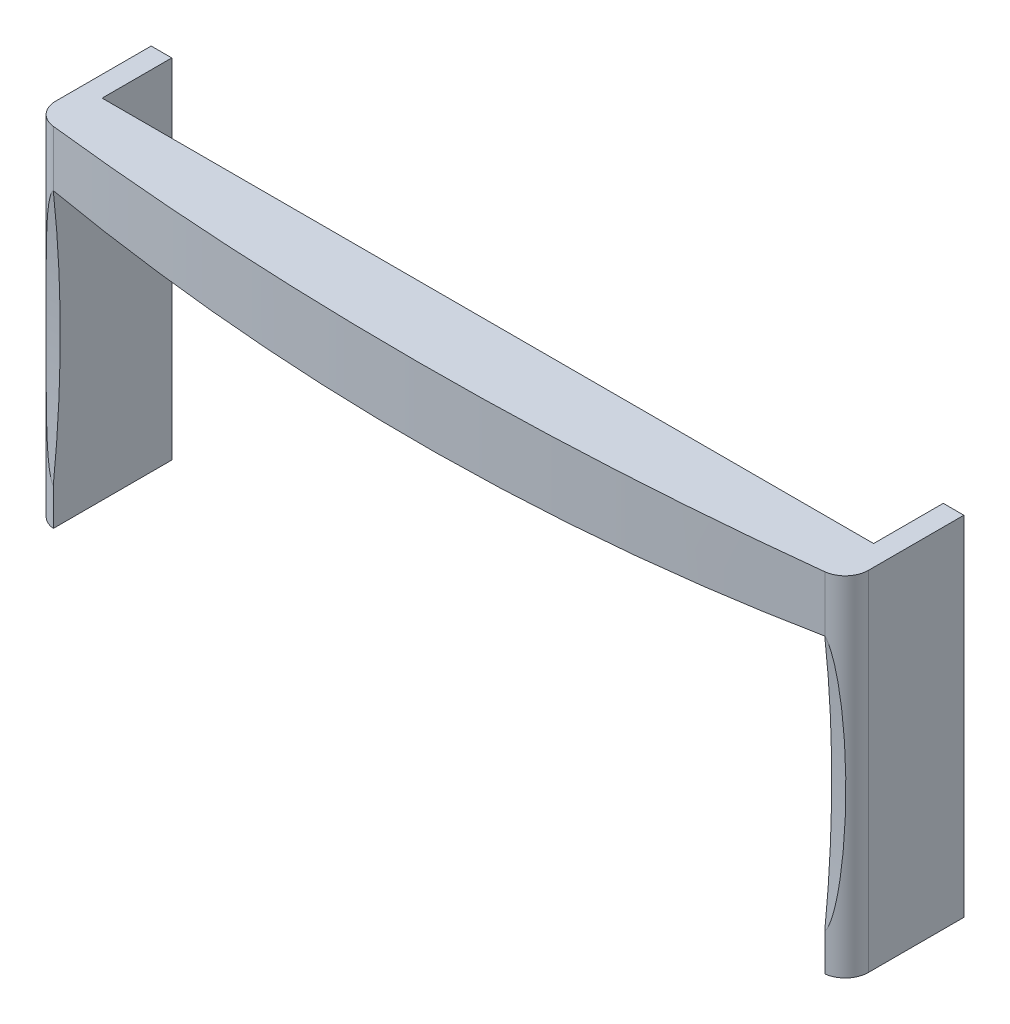
ISO-10303-21;
HEADER;
FILE_DESCRIPTION(('STEP AP214'),'2;1');
FILE_NAME('part.step','',(''),(''),'','','');
FILE_SCHEMA(('AUTOMOTIVE_DESIGN { 1 0 10303 214 1 1 1 1 }'));
ENDSEC;
DATA;
#1=APPLICATION_CONTEXT('core data for automotive mechanical design processes');
#2=APPLICATION_PROTOCOL_DEFINITION('international standard','automotive_design',2000,#1);
#3=PRODUCT_CONTEXT('',#1,'mechanical');
#4=PRODUCT('Part','Part','',(#3));
#5=PRODUCT_RELATED_PRODUCT_CATEGORY('part','',(#4));
#6=PRODUCT_DEFINITION_FORMATION('','',#4);
#7=PRODUCT_DEFINITION_CONTEXT('part definition',#1,'design');
#8=PRODUCT_DEFINITION('design','',#6,#7);
#9=PRODUCT_DEFINITION_SHAPE('','',#8);
#10=(LENGTH_UNIT() NAMED_UNIT(*) SI_UNIT(.MILLI.,.METRE.));
#11=(NAMED_UNIT(*) PLANE_ANGLE_UNIT() SI_UNIT($,.RADIAN.));
#12=(NAMED_UNIT(*) SI_UNIT($,.STERADIAN.) SOLID_ANGLE_UNIT());
#13=UNCERTAINTY_MEASURE_WITH_UNIT(LENGTH_MEASURE(1.E-05),#10,'distance_accuracy_value','');
#14=(GEOMETRIC_REPRESENTATION_CONTEXT(3) GLOBAL_UNCERTAINTY_ASSIGNED_CONTEXT((#13)) GLOBAL_UNIT_ASSIGNED_CONTEXT((#10,
#11,#12)) REPRESENTATION_CONTEXT('',''));
#15=CARTESIAN_POINT('',(0.,0.,0.));
#16=DIRECTION('',(0.,0.,1.));
#17=DIRECTION('',(1.,0.,0.));
#18=AXIS2_PLACEMENT_3D('',#15,#16,#17);
#19=CARTESIAN_POINT('',(-87.5,75.,-12.5));
#20=DIRECTION('',(0.,0.,1.));
#21=DIRECTION('',(1.,0.,0.));
#22=AXIS2_PLACEMENT_3D('',#19,#20,#21);
#23=PLANE('',#22);
#24=DIRECTION('',(0.,-1.,0.));
#25=VECTOR('',#24,1.);
#26=CARTESIAN_POINT('',(-83.0623255897939,75.,-12.5));
#27=LINE('',#26,#25);
#28=CARTESIAN_POINT('',(-83.0623255897939,75.,-12.5));
#29=VERTEX_POINT('',#28);
#30=CARTESIAN_POINT('',(-83.0623255897939,63.,-12.5));
#31=VERTEX_POINT('',#30);
#32=EDGE_CURVE('E57',#29,#31,#27,.T.);
#33=ORIENTED_EDGE('',*,*,#32,.F.);
#34=DIRECTION('',(-1.,0.,0.));
#35=VECTOR('',#34,1.);
#36=CARTESIAN_POINT('',(-87.5,75.,-12.5));
#37=LINE('',#36,#35);
#38=CARTESIAN_POINT('',(83.0623255897938,75.,-12.5));
#39=VERTEX_POINT('',#38);
#40=EDGE_CURVE('E144',#39,#29,#37,.T.);
#41=ORIENTED_EDGE('',*,*,#40,.F.);
#42=DIRECTION('',(0.,1.,0.));
#43=VECTOR('',#42,1.);
#44=CARTESIAN_POINT('',(83.0623255897938,75.,-12.5));
#45=LINE('',#44,#43);
#46=CARTESIAN_POINT('',(83.0623255897938,63.,-12.5));
#47=VERTEX_POINT('',#46);
#48=EDGE_CURVE('E11',#47,#39,#45,.T.);
#49=ORIENTED_EDGE('',*,*,#48,.F.);
#50=CARTESIAN_POINT('',(-2.63677968348475E-13,1211.39165539748,-12.5));
#51=DIRECTION('',(0.,0.,-1.));
#52=DIRECTION('',(1.,0.,0.));
#53=AXIS2_PLACEMENT_3D('',#50,#51,#52);
#54=CIRCLE('',#53,1151.39165539748);
#55=EDGE_CURVE('E332',#47,#31,#54,.T.);
#56=ORIENTED_EDGE('',*,*,#55,.T.);
#57=EDGE_LOOP('',(#33,#41,#49,#56));
#58=FACE_BOUND('',#57,.T.);
#59=ADVANCED_FACE('F39',(#58),#23,.F.);
#60=CARTESIAN_POINT('',(-2.63677968348475E-13,1211.39165539748,-12.5));
#61=DIRECTION('',(0.,0.,1.));
#62=DIRECTION('',(1.,0.,0.));
#63=AXIS2_PLACEMENT_3D('',#60,#61,#62);
#64=CYLINDRICAL_SURFACE('',#63,1151.39165539748);
#65=DIRECTION('',(0.,0.,1.));
#66=VECTOR('',#65,1.);
#67=CARTESIAN_POINT('',(83.0623255897938,63.,-12.5));
#68=LINE('',#67,#66);
#69=CARTESIAN_POINT('',(83.0623255897938,63.,-1.98413144461507));
#70=VERTEX_POINT('',#69);
#71=EDGE_CURVE('E264',#47,#70,#68,.T.);
#72=ORIENTED_EDGE('',*,*,#71,.T.);
#73=CARTESIAN_POINT('',(83.0623255897936,63.0000000000002,-1.98413144461507));
#74=CARTESIAN_POINT('',(79.6051969151284,62.7499484267229,-2.01148651599017));
#75=CARTESIAN_POINT('',(76.1469426278477,62.5155082683895,-2.03676580314133));
#76=CARTESIAN_POINT('',(69.2284320718336,62.0778676198134,-2.08341384557539));
#77=CARTESIAN_POINT('',(65.7681758034121,61.874667124705,-2.10478260146737));
#78=CARTESIAN_POINT('',(55.3848543274694,61.3119545118768,-2.16338419825874));
#79=CARTESIAN_POINT('',(48.4591584769483,60.9993256270347,-2.19511297428076));
#80=CARTESIAN_POINT('',(34.6123573935238,60.4995395141887,-2.2452736413921));
#81=CARTESIAN_POINT('',(27.6912581041578,60.3122177939343,-2.2637229670076));
#82=CARTESIAN_POINT('',(13.8467725436177,60.0624480194924,-2.28822859928558));
#83=CARTESIAN_POINT('',(6.92338627180859,60.,-2.29428490250476));
#84=CARTESIAN_POINT('',(-6.92338627180956,60.,-2.29428490250479));
#85=CARTESIAN_POINT('',(-13.8467725436186,60.0624480194924,-2.28822859928564));
#86=CARTESIAN_POINT('',(-27.6912581041588,60.3122177939343,-2.26372296700764));
#87=CARTESIAN_POINT('',(-34.6123573935248,60.4995395141887,-2.24527364139208));
#88=CARTESIAN_POINT('',(-48.4591584769493,60.9993256270346,-2.19511297428075));
#89=CARTESIAN_POINT('',(-55.3848543274704,61.3119545118766,-2.1633841982588));
#90=CARTESIAN_POINT('',(-65.7681758034131,61.874667124705,-2.10478260146739));
#91=CARTESIAN_POINT('',(-69.2284320718345,62.0778676198135,-2.08341384557537));
#92=CARTESIAN_POINT('',(-76.1469426278486,62.5155082683897,-2.03676580314126));
#93=CARTESIAN_POINT('',(-79.6051969151294,62.749948426723,-2.0114865159901));
#94=CARTESIAN_POINT('',(-83.0623255897946,63.0000000000001,-1.98413144461503));
#95=B_SPLINE_CURVE_WITH_KNOTS('',3,(#73,#74,#75,#76,#77,#78,#79,#80,#81,#82,#83,#84,#85,#86,#87,
#88,#89,#90,#91,#92,#93,#94),.UNSPECIFIED.,.F.,.F.,(4,2,2,2,2,2,2,2,2,2,4),(0.,10.3987278908166,
20.7974541620188,41.59467220453,62.3645356273484,83.134404820894,103.90427401444,
124.674137437258,145.471355479769,155.870081750971,166.268809641788),.UNSPECIFIED.);
#96=CARTESIAN_POINT('',(-83.0623255897939,63.,-1.98413144461507));
#97=VERTEX_POINT('',#96);
#98=EDGE_CURVE('E199',#70,#97,#95,.T.);
#99=ORIENTED_EDGE('',*,*,#98,.T.);
#100=DIRECTION('',(0.,0.,1.));
#101=VECTOR('',#100,1.);
#102=CARTESIAN_POINT('',(-83.0623255897939,63.,-12.5));
#103=LINE('',#102,#101);
#104=EDGE_CURVE('E265',#31,#97,#103,.T.);
#105=ORIENTED_EDGE('',*,*,#104,.F.);
#106=ORIENTED_EDGE('',*,*,#55,.F.);
#107=EDGE_LOOP('',(#72,#99,#105,#106));
#108=FACE_BOUND('',#107,.T.);
#109=ADVANCED_FACE('F344',(#108),#64,.T.);
#110=CARTESIAN_POINT('',(0.,0.,-735.859243697517));
#111=DIRECTION('',(0.,1.,0.));
#112=DIRECTION('',(0.,0.,1.));
#113=AXIS2_PLACEMENT_3D('',#110,#111,#112);
#114=PLANE('',#113);
#115=CARTESIAN_POINT('',(82.4999999999999,0.,-6.95240981152079));
#116=DIRECTION('',(0.,1.,0.));
#117=DIRECTION('',(0.,0.,1.));
#118=AXIS2_PLACEMENT_3D('',#115,#116,#117);
#119=CIRCLE('',#118,5.);
#120=CARTESIAN_POINT('',(87.5,0.,-6.95240981152079));
#121=VERTEX_POINT('',#120);
#122=CARTESIAN_POINT('',(83.0623255897938,0.,-1.98413144461511));
#123=VERTEX_POINT('',#122);
#124=EDGE_CURVE('E286',#121,#123,#119,.F.);
#125=ORIENTED_EDGE('',*,*,#124,.T.);
#126=DIRECTION('',(0.,0.,1.));
#127=VECTOR('',#126,1.);
#128=CARTESIAN_POINT('',(83.0623255897938,0.,-12.5));
#129=LINE('',#128,#127);
#130=CARTESIAN_POINT('',(83.0623255897938,0.,-27.5));
#131=VERTEX_POINT('',#130);
#132=EDGE_CURVE('E325',#131,#123,#129,.T.);
#133=ORIENTED_EDGE('',*,*,#132,.F.);
#134=DIRECTION('',(-1.,0.,0.));
#135=VECTOR('',#134,1.);
#136=CARTESIAN_POINT('',(87.5,0.,-27.5));
#137=LINE('',#136,#135);
#138=CARTESIAN_POINT('',(87.5,0.,-27.5));
#139=VERTEX_POINT('',#138);
#140=EDGE_CURVE('E177',#139,#131,#137,.T.);
#141=ORIENTED_EDGE('',*,*,#140,.F.);
#142=DIRECTION('',(0.,0.,-1.));
#143=VECTOR('',#142,1.);
#144=CARTESIAN_POINT('',(87.5,0.,-12.5));
#145=LINE('',#144,#143);
#146=EDGE_CURVE('E263',#121,#139,#145,.T.);
#147=ORIENTED_EDGE('',*,*,#146,.F.);
#148=EDGE_LOOP('',(#125,#133,#141,#147));
#149=FACE_BOUND('',#148,.T.);
#150=ADVANCED_FACE('F250',(#149),#114,.F.);
#151=CARTESIAN_POINT('',(0.,75.,-735.859243697517));
#152=DIRECTION('',(0.,-1.,0.));
#153=DIRECTION('',(0.,0.,-1.));
#154=AXIS2_PLACEMENT_3D('',#151,#152,#153);
#155=CYLINDRICAL_SURFACE('',#154,738.5607830887);
#156=DIRECTION('',(0.,-1.,0.));
#157=VECTOR('',#156,1.);
#158=CARTESIAN_POINT('',(-83.0623255897939,75.,-1.98413144461507));
#159=LINE('',#158,#157);
#160=CARTESIAN_POINT('',(-83.0623255897939,75.,-1.98413144461507));
#161=VERTEX_POINT('',#160);
#162=EDGE_CURVE('E291',#161,#97,#159,.T.);
#163=ORIENTED_EDGE('',*,*,#162,.T.);
#164=CARTESIAN_POINT('',(-83.0623255897938,62.9999999999999,-1.98413144461507));
#165=CARTESIAN_POINT('',(-79.6142546084617,62.7506013554238,-1.59386654589265));
#166=CARTESIAN_POINT('',(-76.1624015258945,62.5165448815641,-1.22778901704071));
#167=CARTESIAN_POINT('',(-69.2519357617319,62.0792959738796,-0.544171535068266));
#168=CARTESIAN_POINT('',(-65.793323069465,61.8761035888203,-0.226631658637587));
#169=CARTESIAN_POINT('',(-55.4087685020007,61.3131040495593,0.652918591628506));
#170=CARTESIAN_POINT('',(-48.4739111705184,60.9998601061495,1.1418821142645));
#171=CARTESIAN_POINT('',(-34.6196909061709,60.4998022229502,1.92218242601168));
#172=CARTESIAN_POINT('',(-27.7003964595953,60.3124315816137,2.21438942634101));
#173=CARTESIAN_POINT('',(-13.8540679834071,60.0625307745496,2.60406743408269));
#174=CARTESIAN_POINT('',(-6.9270339917036,60.0000000000001,2.70153939118328));
#175=CARTESIAN_POINT('',(6.92703399170333,60.0000000000001,2.70153939118333));
#176=CARTESIAN_POINT('',(13.8540679834068,60.0625307745496,2.6040674340828));
#177=CARTESIAN_POINT('',(27.7003964595951,60.3124315816137,2.21438942634109));
#178=CARTESIAN_POINT('',(34.6196909061706,60.4998022229501,1.92218242601168));
#179=CARTESIAN_POINT('',(48.4739111705181,60.9998601061497,1.14188211426443));
#180=CARTESIAN_POINT('',(55.4087685020004,61.3131040495597,0.652918591628445));
#181=CARTESIAN_POINT('',(65.7933230694647,61.8761035888205,-0.226631658637638));
#182=CARTESIAN_POINT('',(69.2519357617317,62.0792959738795,-0.544171535068312));
#183=CARTESIAN_POINT('',(76.1624015258943,62.5165448815638,-1.22778901704076));
#184=CARTESIAN_POINT('',(79.6142546084614,62.7506013554235,-1.59386654589271));
#185=CARTESIAN_POINT('',(83.0623255897936,63.,-1.98413144461514));
#186=B_SPLINE_CURVE_WITH_KNOTS('',3,(#164,#165,#166,#167,#168,#169,#170,#171,#172,#173,#174,
#175,#176,#177,#178,#179,#180,#181,#182,#183,#184,#185),.UNSPECIFIED.,.F.,.F.,(4,2,2,2,2,2,2,2,
2,2,4),(0.,10.4368611049466,20.8737387000355,41.746891930098,62.5271104942256,83.3072277166694,
104.087344939113,124.867563503241,145.740716733303,156.177594328392,166.614455433339),.UNSPECIFIED.);
#187=EDGE_CURVE('E254',#97,#70,#186,.T.);
#188=ORIENTED_EDGE('',*,*,#187,.T.);
#189=DIRECTION('',(0.,-1.,0.));
#190=VECTOR('',#189,1.);
#191=CARTESIAN_POINT('',(83.0623255897938,75.,-1.98413144461507));
#192=LINE('',#191,#190);
#193=CARTESIAN_POINT('',(83.0623255897938,75.,-1.98413144461507));
#194=VERTEX_POINT('',#193);
#195=EDGE_CURVE('E295',#70,#194,#192,.F.);
#196=ORIENTED_EDGE('',*,*,#195,.T.);
#197=CARTESIAN_POINT('',(0.,75.,-735.859243697517));
#198=DIRECTION('',(0.,1.,0.));
#199=DIRECTION('',(0.,0.,1.));
#200=AXIS2_PLACEMENT_3D('',#197,#198,#199);
#201=CIRCLE('',#200,738.5607830887);
#202=EDGE_CURVE('E267',#161,#194,#201,.T.);
#203=ORIENTED_EDGE('',*,*,#202,.F.);
#204=EDGE_LOOP('',(#163,#188,#196,#203));
#205=FACE_BOUND('',#204,.T.);
#206=ADVANCED_FACE('F245',(#205),#155,.T.);
#207=CARTESIAN_POINT('',(87.5,75.,-12.5));
#208=DIRECTION('',(-1.,0.,0.));
#209=DIRECTION('',(0.,0.,1.));
#210=AXIS2_PLACEMENT_3D('',#207,#208,#209);
#211=PLANE('',#210);
#212=DIRECTION('',(0.,0.,-1.));
#213=VECTOR('',#212,1.);
#214=CARTESIAN_POINT('',(87.5,75.,-12.5));
#215=LINE('',#214,#213);
#216=CARTESIAN_POINT('',(87.5,75.,-6.95240981152079));
#217=VERTEX_POINT('',#216);
#218=CARTESIAN_POINT('',(87.5,75.,-27.5));
#219=VERTEX_POINT('',#218);
#220=EDGE_CURVE('E270',#217,#219,#215,.T.);
#221=ORIENTED_EDGE('',*,*,#220,.F.);
#222=DIRECTION('',(0.,-1.,0.));
#223=VECTOR('',#222,1.);
#224=CARTESIAN_POINT('',(87.5,75.,-6.95240981152079));
#225=LINE('',#224,#223);
#226=EDGE_CURVE('E143',#217,#121,#225,.T.);
#227=ORIENTED_EDGE('',*,*,#226,.T.);
#228=ORIENTED_EDGE('',*,*,#146,.T.);
#229=DIRECTION('',(0.,-1.,0.));
#230=VECTOR('',#229,1.);
#231=CARTESIAN_POINT('',(87.5,75.,-27.5));
#232=LINE('',#231,#230);
#233=EDGE_CURVE('E173',#219,#139,#232,.T.);
#234=ORIENTED_EDGE('',*,*,#233,.F.);
#235=EDGE_LOOP('',(#221,#227,#228,#234));
#236=FACE_BOUND('',#235,.T.);
#237=ADVANCED_FACE('F249',(#236),#211,.F.);
#238=CARTESIAN_POINT('',(-87.5,75.,-2.5));
#239=DIRECTION('',(1.,0.,0.));
#240=DIRECTION('',(0.,0.,-1.));
#241=AXIS2_PLACEMENT_3D('',#238,#239,#240);
#242=PLANE('',#241);
#243=DIRECTION('',(0.,0.,1.));
#244=VECTOR('',#243,1.);
#245=CARTESIAN_POINT('',(-87.5,0.,-2.5));
#246=LINE('',#245,#244);
#247=CARTESIAN_POINT('',(-87.5,0.,-27.5));
#248=VERTEX_POINT('',#247);
#249=CARTESIAN_POINT('',(-87.5,0.,-6.95240981152079));
#250=VERTEX_POINT('',#249);
#251=EDGE_CURVE('E271',#248,#250,#246,.T.);
#252=ORIENTED_EDGE('',*,*,#251,.T.);
#253=DIRECTION('',(0.,-1.,0.));
#254=VECTOR('',#253,1.);
#255=CARTESIAN_POINT('',(-87.5,75.,-6.95240981152079));
#256=LINE('',#255,#254);
#257=CARTESIAN_POINT('',(-87.5,75.,-6.95240981152079));
#258=VERTEX_POINT('',#257);
#259=EDGE_CURVE('E139',#250,#258,#256,.F.);
#260=ORIENTED_EDGE('',*,*,#259,.T.);
#261=DIRECTION('',(0.,0.,1.));
#262=VECTOR('',#261,1.);
#263=CARTESIAN_POINT('',(-87.5,75.,-2.5));
#264=LINE('',#263,#262);
#265=CARTESIAN_POINT('',(-87.5,75.,-27.5));
#266=VERTEX_POINT('',#265);
#267=EDGE_CURVE('E132',#266,#258,#264,.T.);
#268=ORIENTED_EDGE('',*,*,#267,.F.);
#269=DIRECTION('',(0.,1.,0.));
#270=VECTOR('',#269,1.);
#271=CARTESIAN_POINT('',(-87.5,75.,-27.5));
#272=LINE('',#271,#270);
#273=EDGE_CURVE('E137',#248,#266,#272,.T.);
#274=ORIENTED_EDGE('',*,*,#273,.F.);
#275=EDGE_LOOP('',(#252,#260,#268,#274));
#276=FACE_BOUND('',#275,.T.);
#277=ADVANCED_FACE('F135',(#276),#242,.F.);
#278=CARTESIAN_POINT('',(0.,75.,-735.859243697517));
#279=DIRECTION('',(0.,1.,0.));
#280=DIRECTION('',(0.,0.,1.));
#281=AXIS2_PLACEMENT_3D('',#278,#279,#280);
#282=PLANE('',#281);
#283=ORIENTED_EDGE('',*,*,#202,.T.);
#284=CARTESIAN_POINT('',(82.4999999999999,75.,-6.95240981152079));
#285=DIRECTION('',(0.,1.,0.));
#286=DIRECTION('',(0.,0.,1.));
#287=AXIS2_PLACEMENT_3D('',#284,#285,#286);
#288=CIRCLE('',#287,5.);
#289=EDGE_CURVE('E303',#194,#217,#288,.T.);
#290=ORIENTED_EDGE('',*,*,#289,.T.);
#291=ORIENTED_EDGE('',*,*,#220,.T.);
#292=DIRECTION('',(1.,0.,0.));
#293=VECTOR('',#292,1.);
#294=CARTESIAN_POINT('',(87.5,75.,-27.5));
#295=LINE('',#294,#293);
#296=CARTESIAN_POINT('',(83.0623255897938,75.,-27.5));
#297=VERTEX_POINT('',#296);
#298=EDGE_CURVE('E184',#297,#219,#295,.T.);
#299=ORIENTED_EDGE('',*,*,#298,.F.);
#300=DIRECTION('',(0.,0.,1.));
#301=VECTOR('',#300,1.);
#302=CARTESIAN_POINT('',(83.0623255897938,75.,-27.5));
#303=LINE('',#302,#301);
#304=EDGE_CURVE('E187',#297,#39,#303,.T.);
#305=ORIENTED_EDGE('',*,*,#304,.T.);
#306=ORIENTED_EDGE('',*,*,#40,.T.);
#307=DIRECTION('',(0.,0.,1.));
#308=VECTOR('',#307,1.);
#309=CARTESIAN_POINT('',(-83.0623255897939,75.,-27.5));
#310=LINE('',#309,#308);
#311=CARTESIAN_POINT('',(-83.0623255897939,75.,-27.5));
#312=VERTEX_POINT('',#311);
#313=EDGE_CURVE('E151',#312,#29,#310,.T.);
#314=ORIENTED_EDGE('',*,*,#313,.F.);
#315=DIRECTION('',(1.,0.,0.));
#316=VECTOR('',#315,1.);
#317=CARTESIAN_POINT('',(-87.5,75.,-27.5));
#318=LINE('',#317,#316);
#319=EDGE_CURVE('E147',#266,#312,#318,.T.);
#320=ORIENTED_EDGE('',*,*,#319,.F.);
#321=ORIENTED_EDGE('',*,*,#267,.T.);
#322=CARTESIAN_POINT('',(-82.5,75.,-6.95240981152079));
#323=DIRECTION('',(0.,1.,0.));
#324=DIRECTION('',(0.,0.,1.));
#325=AXIS2_PLACEMENT_3D('',#322,#323,#324);
#326=CIRCLE('',#325,5.);
#327=EDGE_CURVE('E300',#258,#161,#326,.T.);
#328=ORIENTED_EDGE('',*,*,#327,.T.);
#329=EDGE_LOOP('',(#283,#290,#291,#299,#305,#306,#314,#320,#321,#328));
#330=FACE_BOUND('',#329,.T.);
#331=ADVANCED_FACE('F149',(#330),#282,.T.);
#332=ORIENTED_EDGE('',*,*,#251,.F.);
#333=DIRECTION('',(-1.,0.,0.));
#334=VECTOR('',#333,1.);
#335=CARTESIAN_POINT('',(-87.5,0.,-27.5));
#336=LINE('',#335,#334);
#337=CARTESIAN_POINT('',(-83.0623255897939,0.,-27.5));
#338=VERTEX_POINT('',#337);
#339=EDGE_CURVE('E161',#338,#248,#336,.T.);
#340=ORIENTED_EDGE('',*,*,#339,.F.);
#341=DIRECTION('',(0.,0.,1.));
#342=VECTOR('',#341,1.);
#343=CARTESIAN_POINT('',(-83.0623255897939,0.,-12.5));
#344=LINE('',#343,#342);
#345=CARTESIAN_POINT('',(-83.0623255897939,0.,-1.98413144461511));
#346=VERTEX_POINT('',#345);
#347=EDGE_CURVE('E328',#338,#346,#344,.T.);
#348=ORIENTED_EDGE('',*,*,#347,.T.);
#349=CARTESIAN_POINT('',(-82.5,0.,-6.95240981152079));
#350=DIRECTION('',(0.,1.,0.));
#351=DIRECTION('',(0.,0.,1.));
#352=AXIS2_PLACEMENT_3D('',#349,#350,#351);
#353=CIRCLE('',#352,5.);
#354=EDGE_CURVE('E283',#346,#250,#353,.F.);
#355=ORIENTED_EDGE('',*,*,#354,.T.);
#356=EDGE_LOOP('',(#332,#340,#348,#355));
#357=FACE_BOUND('',#356,.T.);
#358=ADVANCED_FACE('F243',(#357),#114,.F.);
#359=CARTESIAN_POINT('',(82.4999999999999,75.,-6.95240981152079));
#360=DIRECTION('',(0.,-1.,0.));
#361=DIRECTION('',(0.,0.,-1.));
#362=AXIS2_PLACEMENT_3D('',#359,#360,#361);
#363=CYLINDRICAL_SURFACE('',#362,5.);
#364=CARTESIAN_POINT('',(83.0623255897938,8.00000000000052,-1.98413144461511));
#365=CARTESIAN_POINT('',(83.1045966677515,8.0439036386659,-1.98893563156759));
#366=CARTESIAN_POINT('',(83.1443826904694,8.08998269972869,-1.99396542588266));
#367=CARTESIAN_POINT('',(83.2197617952005,8.18524503534061,-2.00433565822019));
#368=CARTESIAN_POINT('',(83.255365607114,8.23441984584705,-2.00967524634911));
#369=CARTESIAN_POINT('',(83.3231356655711,8.33452294375121,-2.02051354736533));
#370=CARTESIAN_POINT('',(83.3553239225696,8.3854368022108,-2.02601090915236));
#371=CARTESIAN_POINT('',(83.4171308451213,8.48883072445123,-2.03714198019022));
#372=CARTESIAN_POINT('',(83.4467475597997,8.54131193741963,-2.04277578888218));
#373=CARTESIAN_POINT('',(83.5316890673405,8.6991279193684,-2.05966585191799));
#374=CARTESIAN_POINT('',(83.5839259846067,8.80610670906186,-2.07104854178492));
#375=CARTESIAN_POINT('',(83.6824512610891,9.02297635619596,-2.0939798075773));
#376=CARTESIAN_POINT('',(83.7287260331408,9.13287320000592,-2.10552869797912));
#377=CARTESIAN_POINT('',(83.8567456531316,9.45546976272228,-2.1392116226891));
#378=CARTESIAN_POINT('',(83.9323798557195,9.67057834283203,-2.16139988572932));
#379=CARTESIAN_POINT('',(84.0725447729014,10.1044306822273,-2.20557785059767));
#380=CARTESIAN_POINT('',(84.1370680701996,10.3231767637891,-2.2275674105698));
#381=CARTESIAN_POINT('',(84.2579744046162,10.7631212647453,-2.27120699694335));
#382=CARTESIAN_POINT('',(84.3143506854772,10.9843215575788,-2.29285672841665));
#383=CARTESIAN_POINT('',(84.4207593845187,11.4281990639796,-2.33570541731377));
#384=CARTESIAN_POINT('',(84.4707936111216,11.6508758373874,-2.35690450179706));
#385=CARTESIAN_POINT('',(84.5667321694405,12.101872653457,-2.39923288934928));
#386=CARTESIAN_POINT('',(84.6125323526317,12.3302156603824,-2.42035208624525));
#387=CARTESIAN_POINT('',(84.6997587749192,12.7877962153126,-2.46204295964586));
#388=CARTESIAN_POINT('',(84.7411847090985,13.0170338245242,-2.48261459790703));
#389=CARTESIAN_POINT('',(84.8202970829087,13.4759806793634,-2.52316665776938));
#390=CARTESIAN_POINT('',(84.8579869763667,13.7056892851746,-2.54314761321014));
#391=CARTESIAN_POINT('',(84.9301769373313,14.1656484644495,-2.58252134731906));
#392=CARTESIAN_POINT('',(84.9646770863636,14.3958990239071,-2.60191414101134));
#393=CARTESIAN_POINT('',(85.0631937859451,15.0816228311727,-2.65872051578444));
#394=CARTESIAN_POINT('',(85.1231824165385,15.5377487333759,-2.69526400093137));
#395=CARTESIAN_POINT('',(85.2345694078262,16.4512432983164,-2.7659488462481));
#396=CARTESIAN_POINT('',(85.2859672454287,16.9086120350077,-2.8000900600708));
#397=CARTESIAN_POINT('',(85.3816875566375,17.8243528526564,-2.86593784056478));
#398=CARTESIAN_POINT('',(85.4260086155274,18.2827251157089,-2.89764391977325));
#399=CARTESIAN_POINT('',(85.5086573267631,19.2001765806443,-2.95858948203817));
#400=CARTESIAN_POINT('',(85.5469848557875,19.6592557968771,-2.98782891433579));
#401=CARTESIAN_POINT('',(85.6543384967287,21.0383155710948,-3.07188085714732));
#402=CARTESIAN_POINT('',(85.7156364485795,21.9591307362229,-3.12295596601078));
#403=CARTESIAN_POINT('',(85.8222073945215,23.8020525118521,-3.21505469290318));
#404=CARTESIAN_POINT('',(85.8674821523875,24.7241589689872,-3.25607941708878));
#405=CARTESIAN_POINT('',(85.9444023010251,26.5594850180775,-3.32765895994858));
#406=CARTESIAN_POINT('',(85.9761877368119,27.4726946442301,-3.35832065077438));
#407=CARTESIAN_POINT('',(86.0285802437405,29.2997330127857,-3.40974722248593));
#408=CARTESIAN_POINT('',(86.0491869895149,30.2135617724342,-3.43051181530424));
#409=CARTESIAN_POINT('',(86.0802743563411,32.0409978333645,-3.46211978111364));
#410=CARTESIAN_POINT('',(86.0907612043074,32.9546049245716,-3.47296925479814));
#411=CARTESIAN_POINT('',(86.1021500214998,34.7819230980657,-3.48476262561599));
#412=CARTESIAN_POINT('',(86.1030521721169,35.6956341780574,-3.48570671020945));
#413=CARTESIAN_POINT('',(86.0947930280514,37.6488013760216,-3.47713701452791));
#414=CARTESIAN_POINT('',(86.0842287723413,38.6882459960761,-3.46616516185662));
#415=CARTESIAN_POINT('',(86.0500836533114,40.7670415174613,-3.43140206024324));
#416=CARTESIAN_POINT('',(86.0264986050102,41.8063922811498,-3.40760668978397));
#417=CARTESIAN_POINT('',(85.964573315262,43.8901179451885,-3.34704412625179));
#418=CARTESIAN_POINT('',(85.92615132097,44.9344884489464,-3.31020515697042));
#419=CARTESIAN_POINT('',(85.8553280636669,46.4996138575091,-3.24528604651663));
#420=CARTESIAN_POINT('',(85.8295348613023,47.0208760930245,-3.22204743781164));
#421=CARTESIAN_POINT('',(85.7730161538068,48.0629728578215,-3.1723580757685));
#422=CARTESIAN_POINT('',(85.7422907481278,48.5838073955142,-3.14590738720067));
#423=CARTESIAN_POINT('',(85.6751119438945,49.6270447378163,-3.08969175888274));
#424=CARTESIAN_POINT('',(85.6386359539263,50.1494454005467,-3.05991388854265));
#425=CARTESIAN_POINT('',(85.5591583386451,51.1936018643209,-2.9971451677189));
#426=CARTESIAN_POINT('',(85.5161562065022,51.7153576121041,-2.96415406776246));
#427=CARTESIAN_POINT('',(85.422308855678,52.7595234581625,-2.89488201416811));
#428=CARTESIAN_POINT('',(85.3714406938774,53.2819308883225,-2.85859156906764));
#429=CARTESIAN_POINT('',(85.2603109466359,54.3253842895493,-2.78285262633193));
#430=CARTESIAN_POINT('',(85.2000518403465,54.846430583141,-2.74340496351593));
#431=CARTESIAN_POINT('',(85.0680073498049,55.8848261148637,-2.66155865860218));
#432=CARTESIAN_POINT('',(84.9962669593187,56.4021818704154,-2.61917188769041));
#433=CARTESIAN_POINT('',(84.8770187780796,57.1765113587019,-2.5533398481749));
#434=CARTESIAN_POINT('',(84.835304557517,57.4344735855067,-2.53100807322179));
#435=CARTESIAN_POINT('',(84.7472840423481,57.9495398846077,-2.48562378562763));
#436=CARTESIAN_POINT('',(84.700978030582,58.2066440087533,-2.46257131743889));
#437=CARTESIAN_POINT('',(84.6030999347846,58.7183580652971,-2.41590281373831));
#438=CARTESIAN_POINT('',(84.5515575183784,58.9729739749179,-2.39229047687517));
#439=CARTESIAN_POINT('',(84.4416731113387,59.4807628091245,-2.3444263352252));
#440=CARTESIAN_POINT('',(84.383329382145,59.73393534733,-2.32017436816655));
#441=CARTESIAN_POINT('',(84.2579751169221,60.2376025592246,-2.27116569288159));
#442=CARTESIAN_POINT('',(84.1909803053116,60.4881012198685,-2.24640996744049));
#443=CARTESIAN_POINT('',(84.0451271471004,60.9855501911655,-2.19650665249446));
#444=CARTESIAN_POINT('',(83.9662761783619,61.2325026046143,-2.17135931534526));
#445=CARTESIAN_POINT('',(83.8587075509893,61.5311214038613,-2.14051604562332));
#446=CARTESIAN_POINT('',(83.8384787095625,61.5858547812654,-2.13484459115678));
#447=CARTESIAN_POINT('',(83.7969806798784,61.694929848872,-2.12350656788988));
#448=CARTESIAN_POINT('',(83.7757114191248,61.7492715114763,-2.11783999945804));
#449=CARTESIAN_POINT('',(83.710128272295,61.9117031844321,-2.10084927114785));
#450=CARTESIAN_POINT('',(83.6640722575174,62.0191062354512,-2.08954376318001));
#451=CARTESIAN_POINT('',(83.5664433168976,62.2300154179352,-2.06720936066185));
#452=CARTESIAN_POINT('',(83.5149349035224,62.333551001013,-2.05617879961524));
#453=CARTESIAN_POINT('',(83.4039034912109,62.536218168734,-2.03446438754225));
#454=CARTESIAN_POINT('',(83.3443933971424,62.6353565096582,-2.02378001193478));
#455=CARTESIAN_POINT('',(83.2464509030581,62.7779436532063,-2.00833333158037));
#456=CARTESIAN_POINT('',(83.2124400690444,62.8243587838331,-2.00329137175544));
#457=CARTESIAN_POINT('',(83.1405002364844,62.9145246320011,-1.9934733383313));
#458=CARTESIAN_POINT('',(83.1025484793797,62.958257255714,-1.98869908578251));
#459=CARTESIAN_POINT('',(83.0623255897939,62.9999999999996,-1.98413144461512));
#460=B_SPLINE_CURVE_WITH_KNOTS('',3,(#364,#365,#366,#367,#368,#369,#370,#371,#372,#373,#374,
#375,#376,#377,#378,#379,#380,#381,#382,#383,#384,#385,#386,#387,#388,#389,#390,#391,#392,#393,
#394,#395,#396,#397,#398,#399,#400,#401,#402,#403,#404,#405,#406,#407,#408,#409,#410,#411,#412,
#413,#414,#415,#416,#417,#418,#419,#420,#421,#422,#423,#424,#425,#426,#427,#428,#429,#430,#431,
#432,#433,#434,#435,#436,#437,#438,#439,#440,#441,#442,#443,#444,#445,#446,#447,#448,#449,#450,
#451,#452,#453,#454,#455,#456,#457,#458,#459),.UNSPECIFIED.,.F.,.F.,(4,2,2,2,2,2,2,2,2,2,2,2,2,
2,2,2,2,2,2,2,2,2,2,2,2,2,2,2,2,2,2,2,2,2,2,2,2,2,2,2,2,2,2,2,2,2,2,4),(0.,0.183116647256754,
0.365752724474767,0.547129458788281,0.728642611924393,1.08712464552323,1.44640969572559,
2.13314666262039,2.82034031135841,3.50810061374481,4.1956643595272,4.89715138208128,
5.59868727115889,6.29956844728976,7.00043170485713,8.38481677799425,9.76928611540293,
11.1540318760417,12.538806125129,15.3113388038812,18.0835661973315,20.8262633644627,
23.5690403563572,26.3101286010737,29.0511649704297,32.1696735918974,35.2891851097043,
38.4261364843141,39.9933611573824,41.560554233239,43.1340649876756,44.7076980058526,
46.2860106186267,47.8639072701959,49.4357652915956,50.2225296599928,51.009245596191,
51.7917295661276,52.5744139960155,53.3556953136478,54.1364924515119,54.3123639080325,
54.4882476367669,54.840314409179,55.1886027772836,55.5363360272157,55.7094551626196,
55.8836364198396),.UNSPECIFIED.);
#461=CARTESIAN_POINT('',(83.0623255897938,8.,-1.98413144461506));
#462=VERTEX_POINT('',#461);
#463=EDGE_CURVE('E64',#462,#70,#460,.T.);
#464=ORIENTED_EDGE('',*,*,#463,.F.);
#465=EDGE_CURVE('E296',#123,#462,#192,.F.);
#466=ORIENTED_EDGE('',*,*,#465,.F.);
#467=ORIENTED_EDGE('',*,*,#124,.F.);
#468=ORIENTED_EDGE('',*,*,#226,.F.);
#469=ORIENTED_EDGE('',*,*,#289,.F.);
#470=ORIENTED_EDGE('',*,*,#195,.F.);
#471=EDGE_LOOP('',(#464,#466,#467,#468,#469,#470));
#472=FACE_BOUND('',#471,.T.);
#473=ADVANCED_FACE('F239',(#472),#363,.T.);
#474=CARTESIAN_POINT('',(-82.5,75.,-6.95240981152079));
#475=DIRECTION('',(0.,-1.,0.));
#476=DIRECTION('',(0.,0.,-1.));
#477=AXIS2_PLACEMENT_3D('',#474,#475,#476);
#478=CYLINDRICAL_SURFACE('',#477,5.);
#479=CARTESIAN_POINT('',(-83.0623255897939,62.9999999999995,-1.98413144461511));
#480=CARTESIAN_POINT('',(-83.1045966677516,62.9560963613341,-1.98893563156759));
#481=CARTESIAN_POINT('',(-83.1443826904695,62.9100173002713,-1.99396542588266));
#482=CARTESIAN_POINT('',(-83.2197617952006,62.8147549646594,-2.00433565822019));
#483=CARTESIAN_POINT('',(-83.2553656071141,62.765580154153,-2.00967524634911));
#484=CARTESIAN_POINT('',(-83.3231356655711,62.6654770562488,-2.02051354736533));
#485=CARTESIAN_POINT('',(-83.3553239225697,62.6145631977892,-2.02601090915236));
#486=CARTESIAN_POINT('',(-83.4171308451214,62.5111692755488,-2.03714198019022));
#487=CARTESIAN_POINT('',(-83.4467475597998,62.4586880625804,-2.04277578888218));
#488=CARTESIAN_POINT('',(-83.5316890673406,62.3008720806316,-2.05966585191799));
#489=CARTESIAN_POINT('',(-83.5839259846068,62.1938932909382,-2.07104854178492));
#490=CARTESIAN_POINT('',(-83.6824512610892,61.9770236438041,-2.0939798075773));
#491=CARTESIAN_POINT('',(-83.7287260331409,61.8671267999941,-2.10552869797912));
#492=CARTESIAN_POINT('',(-83.8567456531317,61.5445302372778,-2.1392116226891));
#493=CARTESIAN_POINT('',(-83.9323798557196,61.329421657168,-2.16139988572932));
#494=CARTESIAN_POINT('',(-84.0725447729015,60.8955693177728,-2.20557785059767));
#495=CARTESIAN_POINT('',(-84.1370680701997,60.676823236211,-2.22756741056981));
#496=CARTESIAN_POINT('',(-84.2579744046163,60.2368787352547,-2.27120699694335));
#497=CARTESIAN_POINT('',(-84.3143506854773,60.0156784424213,-2.29285672841665));
#498=CARTESIAN_POINT('',(-84.4207593845187,59.5718009360204,-2.33570541731378));
#499=CARTESIAN_POINT('',(-84.4707936111217,59.3491241626126,-2.35690450179706));
#500=CARTESIAN_POINT('',(-84.5667321694405,58.898127346543,-2.39923288934928));
#501=CARTESIAN_POINT('',(-84.6125323526318,58.6697843396176,-2.42035208624525));
#502=CARTESIAN_POINT('',(-84.6997587749193,58.2122037846875,-2.46204295964586));
#503=CARTESIAN_POINT('',(-84.7411847090986,57.9829661754759,-2.48261459790703));
#504=CARTESIAN_POINT('',(-84.8202970829088,57.5240193206367,-2.52316665776938));
#505=CARTESIAN_POINT('',(-84.8579869763668,57.2943107148254,-2.54314761321014));
#506=CARTESIAN_POINT('',(-84.9301769373314,56.8343515355506,-2.58252134731906));
#507=CARTESIAN_POINT('',(-84.9646770863637,56.604100976093,-2.60191414101134));
#508=CARTESIAN_POINT('',(-85.0631937859452,55.9183771688274,-2.65872051578444));
#509=CARTESIAN_POINT('',(-85.1231824165386,55.4622512666241,-2.69526400093137));
#510=CARTESIAN_POINT('',(-85.2345694078262,54.5487567016836,-2.76594884624808));
#511=CARTESIAN_POINT('',(-85.2859672454287,54.0913879649923,-2.80009006007076));
#512=CARTESIAN_POINT('',(-85.3816875566376,53.1756471473437,-2.86593784056477));
#513=CARTESIAN_POINT('',(-85.4260086155275,52.7172748842911,-2.89764391977328));
#514=CARTESIAN_POINT('',(-85.5086573267632,51.7998234193557,-2.95858948203819));
#515=CARTESIAN_POINT('',(-85.5469848557876,51.340744203123,-2.98782891433577));
#516=CARTESIAN_POINT('',(-85.6543384967287,49.9616844289053,-3.07188085714724));
#517=CARTESIAN_POINT('',(-85.7156364485795,49.0408692637772,-3.12295596601074));
#518=CARTESIAN_POINT('',(-85.8222073945216,47.197947488148,-3.2150546929032));
#519=CARTESIAN_POINT('',(-85.8674821523877,46.2758410310129,-3.25607941708882));
#520=CARTESIAN_POINT('',(-85.9444023010252,44.4405149819226,-3.3276589599486));
#521=CARTESIAN_POINT('',(-85.9761877368119,43.52730535577,-3.35832065077437));
#522=CARTESIAN_POINT('',(-86.0285802437405,41.7002669872144,-3.40974722248591));
#523=CARTESIAN_POINT('',(-86.0491869895151,40.7864382275659,-3.43051181530425));
#524=CARTESIAN_POINT('',(-86.0802743563412,38.9590021666356,-3.46211978111367));
#525=CARTESIAN_POINT('',(-86.0907612043075,38.0453950754285,-3.47296925479815));
#526=CARTESIAN_POINT('',(-86.1021500214999,36.2180769019344,-3.48476262561599));
#527=CARTESIAN_POINT('',(-86.103052172117,35.3043658219426,-3.48570671020945));
#528=CARTESIAN_POINT('',(-86.0947930280514,33.3511986239784,-3.47713701452791));
#529=CARTESIAN_POINT('',(-86.0842287723414,32.3117540039239,-3.46616516185662));
#530=CARTESIAN_POINT('',(-86.0500836533115,30.2329584825386,-3.43140206024324));
#531=CARTESIAN_POINT('',(-86.0264986050103,29.19360771885,-3.40760668978396));
#532=CARTESIAN_POINT('',(-85.9645733152621,27.1098820548113,-3.34704412625178));
#533=CARTESIAN_POINT('',(-85.9261513209701,26.0655115510534,-3.31020515697043));
#534=CARTESIAN_POINT('',(-85.855328063667,24.5003861424908,-3.24528604651663));
#535=CARTESIAN_POINT('',(-85.8295348613024,23.9791239069754,-3.22204743781163));
#536=CARTESIAN_POINT('',(-85.7730161538069,22.9370271421784,-3.1723580757685));
#537=CARTESIAN_POINT('',(-85.7422907481279,22.4161926044857,-3.14590738720067));
#538=CARTESIAN_POINT('',(-85.6751119438945,21.3729552621836,-3.08969175888274));
#539=CARTESIAN_POINT('',(-85.6386359539263,20.8505545994532,-3.05991388854262));
#540=CARTESIAN_POINT('',(-85.5591583386451,19.8063981356791,-2.99714516771889));
#541=CARTESIAN_POINT('',(-85.5161562065024,19.2846423878959,-2.9641540677625));
#542=CARTESIAN_POINT('',(-85.4223088556781,18.2404765418376,-2.89488201416817));
#543=CARTESIAN_POINT('',(-85.3714406938776,17.7180691116777,-2.85859156906766));
#544=CARTESIAN_POINT('',(-85.260310946636,16.6746157104509,-2.78285262633192));
#545=CARTESIAN_POINT('',(-85.2000518403465,16.1535694168592,-2.7434049635159));
#546=CARTESIAN_POINT('',(-85.068007349805,15.1151738851365,-2.66155865860217));
#547=CARTESIAN_POINT('',(-84.9962669593188,14.5978181295847,-2.61917188769042));
#548=CARTESIAN_POINT('',(-84.8770187780797,13.8234886412982,-2.55333984817493));
#549=CARTESIAN_POINT('',(-84.8353045575172,13.5655264144934,-2.53100807322182));
#550=CARTESIAN_POINT('',(-84.7472840423483,13.0504601153923,-2.48562378562768));
#551=CARTESIAN_POINT('',(-84.7009780305822,12.7933559912467,-2.46257131743896));
#552=CARTESIAN_POINT('',(-84.6030999347847,12.2816419347029,-2.41590281373834));
#553=CARTESIAN_POINT('',(-84.5515575183784,12.027026025082,-2.39229047687513));
#554=CARTESIAN_POINT('',(-84.4416731113386,11.5192371908754,-2.34442633522512));
#555=CARTESIAN_POINT('',(-84.3833293821449,11.2660646526699,-2.32017436816649));
#556=CARTESIAN_POINT('',(-84.2579751169222,10.7623974407752,-2.27116569288159));
#557=CARTESIAN_POINT('',(-84.1909803053118,10.5118987801313,-2.24640996744051));
#558=CARTESIAN_POINT('',(-84.0451271471003,10.0144498088343,-2.1965066524944));
#559=CARTESIAN_POINT('',(-83.9662761783614,9.76749739538562,-2.1713593153451));
#560=CARTESIAN_POINT('',(-83.8587075509892,9.46887859613843,-2.14051604562327));
#561=CARTESIAN_POINT('',(-83.8384787095625,9.41414521873422,-2.13484459115677));
#562=CARTESIAN_POINT('',(-83.7969806798784,9.30507015112759,-2.12350656788986));
#563=CARTESIAN_POINT('',(-83.7757114191247,9.25072848852339,-2.11783999945799));
#564=CARTESIAN_POINT('',(-83.7101282722946,9.08829681556765,-2.10084927114773));
#565=CARTESIAN_POINT('',(-83.6640722575171,8.98089376454848,-2.0895437631799));
#566=CARTESIAN_POINT('',(-83.5664433168975,8.76998458206431,-2.06720936066181));
#567=CARTESIAN_POINT('',(-83.5149349035225,8.66644899898638,-2.05617879961526));
#568=CARTESIAN_POINT('',(-83.403903491211,8.4637818312654,-2.03446438754226));
#569=CARTESIAN_POINT('',(-83.3443933971422,8.36464349034141,-2.02378001193474));
#570=CARTESIAN_POINT('',(-83.246450903058,8.22205634679332,-2.00833333158034));
#571=CARTESIAN_POINT('',(-83.2124400690445,8.17564121616648,-2.00329137175544));
#572=CARTESIAN_POINT('',(-83.1405002364846,8.08547536799854,-1.99347333833132));
#573=CARTESIAN_POINT('',(-83.1025484793799,8.04174274428586,-1.98869908578252));
#574=CARTESIAN_POINT('',(-83.0623255897938,8.00000000000059,-1.98413144461509));
#575=B_SPLINE_CURVE_WITH_KNOTS('',3,(#479,#480,#481,#482,#483,#484,#485,#486,#487,#488,#489,
#490,#491,#492,#493,#494,#495,#496,#497,#498,#499,#500,#501,#502,#503,#504,#505,#506,#507,#508,
#509,#510,#511,#512,#513,#514,#515,#516,#517,#518,#519,#520,#521,#522,#523,#524,#525,#526,#527,
#528,#529,#530,#531,#532,#533,#534,#535,#536,#537,#538,#539,#540,#541,#542,#543,#544,#545,#546,
#547,#548,#549,#550,#551,#552,#553,#554,#555,#556,#557,#558,#559,#560,#561,#562,#563,#564,#565,
#566,#567,#568,#569,#570,#571,#572,#573,#574),.UNSPECIFIED.,.F.,.F.,(4,2,2,2,2,2,2,2,2,2,2,2,2,
2,2,2,2,2,2,2,2,2,2,2,2,2,2,2,2,2,2,2,2,2,2,2,2,2,2,2,2,2,2,2,2,2,2,4),(0.,0.183116647256758,
0.365752724474773,0.547129458788279,0.728642611924394,1.08712464552323,1.44640969572559,
2.13314666262039,2.8203403113584,3.50810061374481,4.19566435952721,4.89715138208128,
5.59868727115889,6.29956844728975,7.00043170485713,8.38481677799424,9.76928611540291,
11.1540318760417,12.538806125129,15.3113388038811,18.0835661973314,20.8262633644626,
23.5690403563572,26.3101286010737,29.0511649704297,32.1696735918975,35.2891851097046,
38.4261364843143,39.9933611573825,41.5605542332392,43.1340649876756,44.7076980058526,
46.2860106186266,47.8639072701957,49.4357652915955,50.2225296599928,51.009245596191,
51.7917295661277,52.5744139960157,53.355695313648,54.1364924515122,54.3123639080328,
54.4882476367673,54.8403144091795,55.1886027772842,55.5363360272163,55.7094551626199,
55.8836364198396),.UNSPECIFIED.);
#576=CARTESIAN_POINT('',(-83.0623255897939,7.99999999999999,-1.98413144461507));
#577=VERTEX_POINT('',#576);
#578=EDGE_CURVE('E209',#97,#577,#575,.T.);
#579=ORIENTED_EDGE('',*,*,#578,.F.);
#580=ORIENTED_EDGE('',*,*,#162,.F.);
#581=ORIENTED_EDGE('',*,*,#327,.F.);
#582=ORIENTED_EDGE('',*,*,#259,.F.);
#583=ORIENTED_EDGE('',*,*,#354,.F.);
#584=EDGE_CURVE('E290',#577,#346,#159,.T.);
#585=ORIENTED_EDGE('',*,*,#584,.F.);
#586=EDGE_LOOP('',(#579,#580,#581,#582,#583,#585));
#587=FACE_BOUND('',#586,.T.);
#588=ADVANCED_FACE('F41',(#587),#478,.T.);
#589=ORIENTED_EDGE('',*,*,#187,.F.);
#590=CARTESIAN_POINT('',(-2.63677968348475E-13,1211.39165539748,-1.98413144461514));
#591=DIRECTION('',(0.,0.,1.));
#592=DIRECTION('',(0.,-1.,0.));
#593=AXIS2_PLACEMENT_3D('',#590,#591,#592);
#594=CIRCLE('',#593,1151.39165539748);
#595=EDGE_CURVE('E195',#97,#70,#594,.T.);
#596=ORIENTED_EDGE('',*,*,#595,.T.);
#597=EDGE_LOOP('',(#589,#596));
#598=FACE_BOUND('',#597,.T.);
#599=ADVANCED_FACE('F215',(#598),#64,.T.);
#600=CARTESIAN_POINT('',(83.0623255897938,63.,-12.5));
#601=DIRECTION('',(1.,0.,0.));
#602=DIRECTION('',(0.,1.,0.));
#603=AXIS2_PLACEMENT_3D('',#600,#601,#602);
#604=PLANE('',#603);
#605=ORIENTED_EDGE('',*,*,#465,.T.);
#606=CARTESIAN_POINT('',(83.0623255897938,35.5,249.349201888718));
#607=DIRECTION('',(1.,0.,0.));
#608=DIRECTION('',(0.,1.,0.));
#609=AXIS2_PLACEMENT_3D('',#606,#607,#608);
#610=CIRCLE('',#609,252.833333333333);
#611=EDGE_CURVE('E237',#462,#70,#610,.T.);
#612=ORIENTED_EDGE('',*,*,#611,.T.);
#613=ORIENTED_EDGE('',*,*,#71,.F.);
#614=ORIENTED_EDGE('',*,*,#48,.T.);
#615=ORIENTED_EDGE('',*,*,#304,.F.);
#616=DIRECTION('',(0.,1.,0.));
#617=VECTOR('',#616,1.);
#618=CARTESIAN_POINT('',(83.0623255897938,75.,-27.5));
#619=LINE('',#618,#617);
#620=EDGE_CURVE('E181',#131,#297,#619,.T.);
#621=ORIENTED_EDGE('',*,*,#620,.F.);
#622=ORIENTED_EDGE('',*,*,#132,.T.);
#623=EDGE_LOOP('',(#605,#612,#613,#614,#615,#621,#622));
#624=FACE_BOUND('',#623,.T.);
#625=ADVANCED_FACE('F228',(#624),#604,.F.);
#626=CARTESIAN_POINT('',(-83.0623255897939,63.,-12.5));
#627=DIRECTION('',(-1.,0.,0.));
#628=DIRECTION('',(0.,0.,1.));
#629=AXIS2_PLACEMENT_3D('',#626,#627,#628);
#630=PLANE('',#629);
#631=ORIENTED_EDGE('',*,*,#104,.T.);
#632=CARTESIAN_POINT('',(-83.0623255897939,35.5,249.349201888718));
#633=DIRECTION('',(-1.,0.,0.));
#634=DIRECTION('',(0.,0.,1.));
#635=AXIS2_PLACEMENT_3D('',#632,#633,#634);
#636=CIRCLE('',#635,252.833333333333);
#637=EDGE_CURVE('E44',#97,#577,#636,.T.);
#638=ORIENTED_EDGE('',*,*,#637,.T.);
#639=ORIENTED_EDGE('',*,*,#584,.T.);
#640=ORIENTED_EDGE('',*,*,#347,.F.);
#641=DIRECTION('',(0.,-1.,0.));
#642=VECTOR('',#641,1.);
#643=CARTESIAN_POINT('',(-83.0623255897939,75.,-27.5));
#644=LINE('',#643,#642);
#645=EDGE_CURVE('E156',#312,#338,#644,.T.);
#646=ORIENTED_EDGE('',*,*,#645,.F.);
#647=ORIENTED_EDGE('',*,*,#313,.T.);
#648=ORIENTED_EDGE('',*,*,#32,.T.);
#649=EDGE_LOOP('',(#631,#638,#639,#640,#646,#647,#648));
#650=FACE_BOUND('',#649,.T.);
#651=ADVANCED_FACE('F312',(#650),#630,.F.);
#652=CARTESIAN_POINT('',(87.5,35.5,249.349201888718));
#653=DIRECTION('',(-1.,0.,0.));
#654=DIRECTION('',(0.,0.,1.));
#655=AXIS2_PLACEMENT_3D('',#652,#653,#654);
#656=CYLINDRICAL_SURFACE('',#655,252.833333333333);
#657=ORIENTED_EDGE('',*,*,#578,.T.);
#658=ORIENTED_EDGE('',*,*,#637,.F.);
#659=EDGE_LOOP('',(#657,#658));
#660=FACE_BOUND('',#659,.T.);
#661=ADVANCED_FACE('F225',(#660),#656,.F.);
#662=ORIENTED_EDGE('',*,*,#463,.T.);
#663=ORIENTED_EDGE('',*,*,#611,.F.);
#664=EDGE_LOOP('',(#662,#663));
#665=FACE_BOUND('',#664,.T.);
#666=ADVANCED_FACE('F219',(#665),#656,.F.);
#667=DIRECTION('',(-1.,0.,0.));
#668=VECTOR('',#667,1.);
#669=CARTESIAN_POINT('',(87.5,63.,-1.98413144461507));
#670=LINE('',#669,#668);
#671=EDGE_CURVE('E192',#70,#97,#670,.T.);
#672=ORIENTED_EDGE('',*,*,#671,.T.);
#673=ORIENTED_EDGE('',*,*,#98,.F.);
#674=EDGE_LOOP('',(#672,#673));
#675=FACE_BOUND('',#674,.T.);
#676=ADVANCED_FACE('F224',(#675),#656,.F.);
#677=CARTESIAN_POINT('',(87.5,63.,-1.98413144461507));
#678=DIRECTION('',(0.,0.,1.));
#679=DIRECTION('',(0.,-1.,0.));
#680=AXIS2_PLACEMENT_3D('',#677,#678,#679);
#681=PLANE('',#680);
#682=ORIENTED_EDGE('',*,*,#671,.F.);
#683=ORIENTED_EDGE('',*,*,#595,.F.);
#684=EDGE_LOOP('',(#682,#683));
#685=FACE_BOUND('',#684,.T.);
#686=ADVANCED_FACE('F226',(#685),#681,.F.);
#687=CARTESIAN_POINT('',(0.,0.,-27.5));
#688=DIRECTION('',(0.,0.,-1.));
#689=DIRECTION('',(-1.,0.,0.));
#690=AXIS2_PLACEMENT_3D('',#687,#688,#689);
#691=PLANE('',#690);
#692=ORIENTED_EDGE('',*,*,#233,.T.);
#693=ORIENTED_EDGE('',*,*,#140,.T.);
#694=ORIENTED_EDGE('',*,*,#620,.T.);
#695=ORIENTED_EDGE('',*,*,#298,.T.);
#696=EDGE_LOOP('',(#692,#693,#694,#695));
#697=FACE_BOUND('',#696,.T.);
#698=ADVANCED_FACE('F379',(#697),#691,.T.);
#699=CARTESIAN_POINT('',(0.,0.,-27.5));
#700=DIRECTION('',(0.,0.,1.));
#701=DIRECTION('',(1.,0.,0.));
#702=AXIS2_PLACEMENT_3D('',#699,#700,#701);
#703=PLANE('',#702);
#704=ORIENTED_EDGE('',*,*,#273,.T.);
#705=ORIENTED_EDGE('',*,*,#319,.T.);
#706=ORIENTED_EDGE('',*,*,#645,.T.);
#707=ORIENTED_EDGE('',*,*,#339,.T.);
#708=EDGE_LOOP('',(#704,#705,#706,#707));
#709=FACE_BOUND('',#708,.T.);
#710=ADVANCED_FACE('F159',(#709),#703,.F.);
#711=CLOSED_SHELL('',(#59,#109,#150,#206,#237,#277,#331,#358,#473,#588,#599,#625,#651,#661,#666,
#676,#686,#698,#710));
#712=MANIFOLD_SOLID_BREP('B2',#711);
#713=ADVANCED_BREP_SHAPE_REPRESENTATION('',(#18,#712),#14);
#714=SHAPE_DEFINITION_REPRESENTATION(#9,#713);
ENDSEC;
END-ISO-10303-21;
